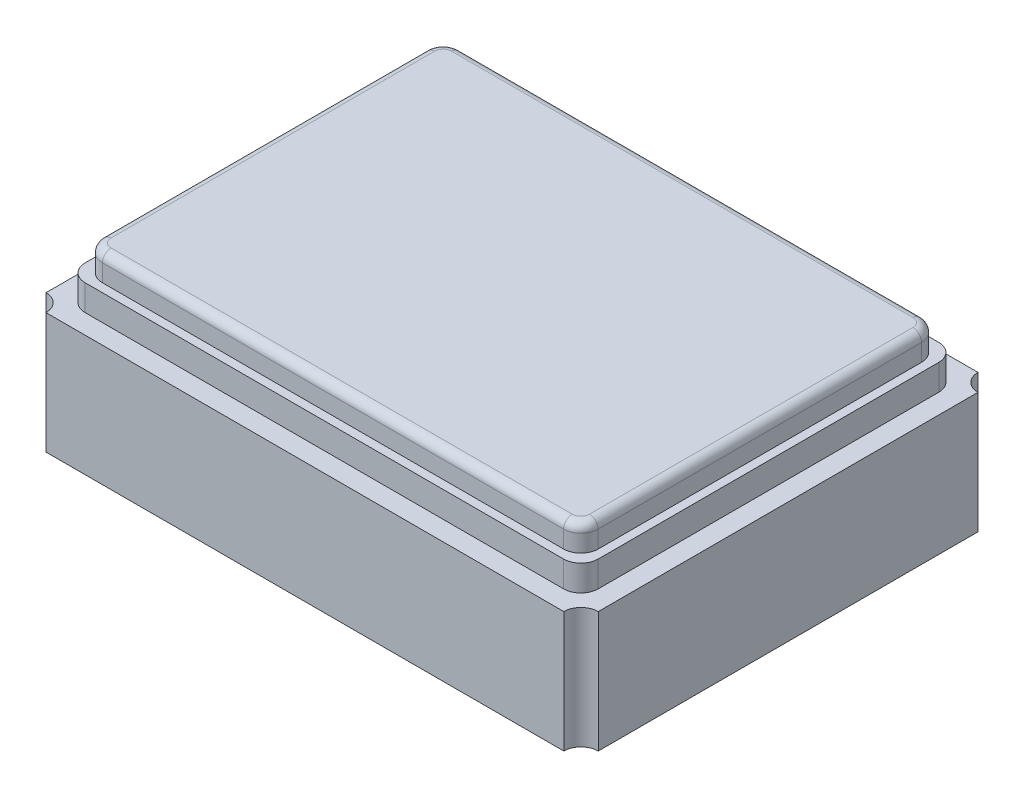
ISO-10303-21;
HEADER;
FILE_DESCRIPTION(('STEP AP214'),'2;1');
FILE_NAME('part.step','',(''),(''),'','','');
FILE_SCHEMA(('AUTOMOTIVE_DESIGN { 1 0 10303 214 1 1 1 1 }'));
ENDSEC;
DATA;
#1=APPLICATION_CONTEXT('core data for automotive mechanical design processes');
#2=APPLICATION_PROTOCOL_DEFINITION('international standard','automotive_design',2000,#1);
#3=PRODUCT_CONTEXT('',#1,'mechanical');
#4=PRODUCT('Part','Part','',(#3));
#5=PRODUCT_RELATED_PRODUCT_CATEGORY('part','',(#4));
#6=PRODUCT_DEFINITION_FORMATION('','',#4);
#7=PRODUCT_DEFINITION_CONTEXT('part definition',#1,'design');
#8=PRODUCT_DEFINITION('design','',#6,#7);
#9=PRODUCT_DEFINITION_SHAPE('','',#8);
#10=(LENGTH_UNIT() NAMED_UNIT(*) SI_UNIT(.MILLI.,.METRE.));
#11=(NAMED_UNIT(*) PLANE_ANGLE_UNIT() SI_UNIT($,.RADIAN.));
#12=(NAMED_UNIT(*) SI_UNIT($,.STERADIAN.) SOLID_ANGLE_UNIT());
#13=UNCERTAINTY_MEASURE_WITH_UNIT(LENGTH_MEASURE(1.E-05),#10,'distance_accuracy_value','');
#14=(GEOMETRIC_REPRESENTATION_CONTEXT(3) GLOBAL_UNCERTAINTY_ASSIGNED_CONTEXT((#13)) GLOBAL_UNIT_ASSIGNED_CONTEXT((#10,
#11,#12)) REPRESENTATION_CONTEXT('',''));
#15=CARTESIAN_POINT('',(0.,0.,0.));
#16=DIRECTION('',(0.,0.,1.));
#17=DIRECTION('',(1.,0.,0.));
#18=AXIS2_PLACEMENT_3D('',#15,#16,#17);
#19=CARTESIAN_POINT('',(-1.33609678096629,1.,0.936846899512658));
#20=DIRECTION('',(0.,-1.,0.));
#21=DIRECTION('',(0.,0.,-1.));
#22=AXIS2_PLACEMENT_3D('',#19,#20,#21);
#23=CYLINDRICAL_SURFACE('',#22,0.0999999999999999);
#24=DIRECTION('',(0.,-1.,0.));
#25=VECTOR('',#24,1.);
#26=CARTESIAN_POINT('',(-1.33609678096629,1.,1.03684689951266));
#27=LINE('',#26,#25);
#28=CARTESIAN_POINT('',(-1.33609678096629,0.95,1.03684689951266));
#29=VERTEX_POINT('',#28);
#30=CARTESIAN_POINT('',(-1.33609678096629,0.85,1.03684689951266));
#31=VERTEX_POINT('',#30);
#32=EDGE_CURVE('E132',#29,#31,#27,.T.);
#33=ORIENTED_EDGE('',*,*,#32,.F.);
#34=CARTESIAN_POINT('',(-1.33609678096629,0.95,0.936846899512658));
#35=DIRECTION('',(0.,-1.,0.));
#36=DIRECTION('',(0.,0.,-1.));
#37=AXIS2_PLACEMENT_3D('',#34,#35,#36);
#38=CIRCLE('',#37,0.0999999999999999);
#39=CARTESIAN_POINT('',(-1.43609678096628,0.95,0.936846899512658));
#40=VERTEX_POINT('',#39);
#41=EDGE_CURVE('E12',#29,#40,#38,.T.);
#42=ORIENTED_EDGE('',*,*,#41,.T.);
#43=DIRECTION('',(0.,-1.,0.));
#44=VECTOR('',#43,1.);
#45=CARTESIAN_POINT('',(-1.43609678096628,1.,0.936846899512658));
#46=LINE('',#45,#44);
#47=CARTESIAN_POINT('',(-1.43609678096628,0.85,0.936846899512658));
#48=VERTEX_POINT('',#47);
#49=EDGE_CURVE('E153',#40,#48,#46,.T.);
#50=ORIENTED_EDGE('',*,*,#49,.T.);
#51=CARTESIAN_POINT('',(-1.33609678096629,0.85,0.936846899512658));
#52=DIRECTION('',(0.,1.,0.));
#53=DIRECTION('',(0.,0.,-1.));
#54=AXIS2_PLACEMENT_3D('',#51,#52,#53);
#55=CIRCLE('',#54,0.0999999999999999);
#56=EDGE_CURVE('E147',#48,#31,#55,.T.);
#57=ORIENTED_EDGE('',*,*,#56,.T.);
#58=EDGE_LOOP('',(#33,#42,#50,#57));
#59=FACE_BOUND('',#58,.T.);
#60=ADVANCED_FACE('F44',(#59),#23,.T.);
#61=CARTESIAN_POINT('',(-1.33609678096629,1.,1.03684689951266));
#62=DIRECTION('',(0.,0.,-1.));
#63=DIRECTION('',(-1.,0.,0.));
#64=AXIS2_PLACEMENT_3D('',#61,#62,#63);
#65=PLANE('',#64);
#66=DIRECTION('',(0.,-1.,0.));
#67=VECTOR('',#66,1.);
#68=CARTESIAN_POINT('',(1.33609678096629,1.,1.03684689951266));
#69=LINE('',#68,#67);
#70=CARTESIAN_POINT('',(1.33609678096629,0.95,1.03684689951266));
#71=VERTEX_POINT('',#70);
#72=CARTESIAN_POINT('',(1.33609678096629,0.85,1.03684689951266));
#73=VERTEX_POINT('',#72);
#74=EDGE_CURVE('E141',#71,#73,#69,.T.);
#75=ORIENTED_EDGE('',*,*,#74,.F.);
#76=DIRECTION('',(1.,0.,0.));
#77=VECTOR('',#76,1.);
#78=CARTESIAN_POINT('',(-1.33609678096629,0.95,1.03684689951266));
#79=LINE('',#78,#77);
#80=EDGE_CURVE('E53',#71,#29,#79,.F.);
#81=ORIENTED_EDGE('',*,*,#80,.T.);
#82=ORIENTED_EDGE('',*,*,#32,.T.);
#83=DIRECTION('',(1.,0.,0.));
#84=VECTOR('',#83,1.);
#85=CARTESIAN_POINT('',(-1.33609678096629,0.85,1.03684689951266));
#86=LINE('',#85,#84);
#87=EDGE_CURVE('E135',#31,#73,#86,.T.);
#88=ORIENTED_EDGE('',*,*,#87,.T.);
#89=EDGE_LOOP('',(#75,#81,#82,#88));
#90=FACE_BOUND('',#89,.T.);
#91=ADVANCED_FACE('F134',(#90),#65,.F.);
#92=CARTESIAN_POINT('',(1.33609678096629,1.,0.936846899512658));
#93=DIRECTION('',(0.,-1.,0.));
#94=DIRECTION('',(0.,0.,-1.));
#95=AXIS2_PLACEMENT_3D('',#92,#93,#94);
#96=CYLINDRICAL_SURFACE('',#95,0.1);
#97=DIRECTION('',(0.,-1.,0.));
#98=VECTOR('',#97,1.);
#99=CARTESIAN_POINT('',(1.43609678096629,1.,0.936846899512658));
#100=LINE('',#99,#98);
#101=CARTESIAN_POINT('',(1.43609678096629,0.95,0.936846899512658));
#102=VERTEX_POINT('',#101);
#103=CARTESIAN_POINT('',(1.43609678096629,0.85,0.936846899512658));
#104=VERTEX_POINT('',#103);
#105=EDGE_CURVE('E183',#102,#104,#100,.T.);
#106=ORIENTED_EDGE('',*,*,#105,.F.);
#107=CARTESIAN_POINT('',(1.33609678096629,0.95,0.936846899512658));
#108=DIRECTION('',(0.,-1.,0.));
#109=DIRECTION('',(0.,0.,-1.));
#110=AXIS2_PLACEMENT_3D('',#107,#108,#109);
#111=CIRCLE('',#110,0.1);
#112=EDGE_CURVE('E68',#102,#71,#111,.T.);
#113=ORIENTED_EDGE('',*,*,#112,.T.);
#114=ORIENTED_EDGE('',*,*,#74,.T.);
#115=CARTESIAN_POINT('',(1.33609678096629,0.85,0.936846899512658));
#116=DIRECTION('',(0.,1.,0.));
#117=DIRECTION('',(0.,0.,1.));
#118=AXIS2_PLACEMENT_3D('',#115,#116,#117);
#119=CIRCLE('',#118,0.1);
#120=EDGE_CURVE('E150',#73,#104,#119,.T.);
#121=ORIENTED_EDGE('',*,*,#120,.T.);
#122=EDGE_LOOP('',(#106,#113,#114,#121));
#123=FACE_BOUND('',#122,.T.);
#124=ADVANCED_FACE('F286',(#123),#96,.T.);
#125=CARTESIAN_POINT('',(1.43609678096629,1.,0.936846899512658));
#126=DIRECTION('',(-1.,0.,0.));
#127=DIRECTION('',(0.,0.,1.));
#128=AXIS2_PLACEMENT_3D('',#125,#126,#127);
#129=PLANE('',#128);
#130=DIRECTION('',(0.,-1.,0.));
#131=VECTOR('',#130,1.);
#132=CARTESIAN_POINT('',(1.43609678096629,1.,-0.936846899512658));
#133=LINE('',#132,#131);
#134=CARTESIAN_POINT('',(1.43609678096629,0.95,-0.936846899512658));
#135=VERTEX_POINT('',#134);
#136=CARTESIAN_POINT('',(1.43609678096629,0.85,-0.936846899512658));
#137=VERTEX_POINT('',#136);
#138=EDGE_CURVE('E181',#135,#137,#133,.T.);
#139=ORIENTED_EDGE('',*,*,#138,.F.);
#140=DIRECTION('',(0.,0.,-1.));
#141=VECTOR('',#140,1.);
#142=CARTESIAN_POINT('',(1.43609678096629,0.95,0.936846899512658));
#143=LINE('',#142,#141);
#144=EDGE_CURVE('E211',#135,#102,#143,.F.);
#145=ORIENTED_EDGE('',*,*,#144,.T.);
#146=ORIENTED_EDGE('',*,*,#105,.T.);
#147=DIRECTION('',(0.,0.,-1.));
#148=VECTOR('',#147,1.);
#149=CARTESIAN_POINT('',(1.43609678096629,0.85,0.936846899512658));
#150=LINE('',#149,#148);
#151=EDGE_CURVE('E160',#104,#137,#150,.T.);
#152=ORIENTED_EDGE('',*,*,#151,.T.);
#153=EDGE_LOOP('',(#139,#145,#146,#152));
#154=FACE_BOUND('',#153,.T.);
#155=ADVANCED_FACE('F284',(#154),#129,.F.);
#156=CARTESIAN_POINT('',(1.33609678096629,1.,-0.936846899512658));
#157=DIRECTION('',(0.,-1.,0.));
#158=DIRECTION('',(0.,0.,-1.));
#159=AXIS2_PLACEMENT_3D('',#156,#157,#158);
#160=CYLINDRICAL_SURFACE('',#159,0.1);
#161=DIRECTION('',(0.,-1.,0.));
#162=VECTOR('',#161,1.);
#163=CARTESIAN_POINT('',(1.33609678096629,1.,-1.03684689951266));
#164=LINE('',#163,#162);
#165=CARTESIAN_POINT('',(1.33609678096629,0.95,-1.03684689951266));
#166=VERTEX_POINT('',#165);
#167=CARTESIAN_POINT('',(1.33609678096629,0.85,-1.03684689951266));
#168=VERTEX_POINT('',#167);
#169=EDGE_CURVE('E179',#166,#168,#164,.T.);
#170=ORIENTED_EDGE('',*,*,#169,.F.);
#171=CARTESIAN_POINT('',(1.33609678096629,0.95,-0.936846899512658));
#172=DIRECTION('',(0.,-1.,0.));
#173=DIRECTION('',(0.,0.,-1.));
#174=AXIS2_PLACEMENT_3D('',#171,#172,#173);
#175=CIRCLE('',#174,0.1);
#176=EDGE_CURVE('E209',#166,#135,#175,.T.);
#177=ORIENTED_EDGE('',*,*,#176,.T.);
#178=ORIENTED_EDGE('',*,*,#138,.T.);
#179=CARTESIAN_POINT('',(1.33609678096629,0.85,-0.936846899512658));
#180=DIRECTION('',(0.,1.,0.));
#181=DIRECTION('',(0.,0.,1.));
#182=AXIS2_PLACEMENT_3D('',#179,#180,#181);
#183=CIRCLE('',#182,0.1);
#184=EDGE_CURVE('E163',#137,#168,#183,.T.);
#185=ORIENTED_EDGE('',*,*,#184,.T.);
#186=EDGE_LOOP('',(#170,#177,#178,#185));
#187=FACE_BOUND('',#186,.T.);
#188=ADVANCED_FACE('F282',(#187),#160,.T.);
#189=CARTESIAN_POINT('',(1.33609678096629,1.,-1.03684689951266));
#190=DIRECTION('',(0.,0.,1.));
#191=DIRECTION('',(1.,0.,0.));
#192=AXIS2_PLACEMENT_3D('',#189,#190,#191);
#193=PLANE('',#192);
#194=DIRECTION('',(0.,-1.,0.));
#195=VECTOR('',#194,1.);
#196=CARTESIAN_POINT('',(-1.33609678096629,1.,-1.03684689951266));
#197=LINE('',#196,#195);
#198=CARTESIAN_POINT('',(-1.33609678096629,0.95,-1.03684689951266));
#199=VERTEX_POINT('',#198);
#200=CARTESIAN_POINT('',(-1.33609678096629,0.85,-1.03684689951266));
#201=VERTEX_POINT('',#200);
#202=EDGE_CURVE('E177',#199,#201,#197,.T.);
#203=ORIENTED_EDGE('',*,*,#202,.F.);
#204=DIRECTION('',(-1.,0.,0.));
#205=VECTOR('',#204,1.);
#206=CARTESIAN_POINT('',(1.33609678096629,0.95,-1.03684689951266));
#207=LINE('',#206,#205);
#208=EDGE_CURVE('E207',#199,#166,#207,.F.);
#209=ORIENTED_EDGE('',*,*,#208,.T.);
#210=ORIENTED_EDGE('',*,*,#169,.T.);
#211=DIRECTION('',(-1.,0.,0.));
#212=VECTOR('',#211,1.);
#213=CARTESIAN_POINT('',(1.33609678096629,0.85,-1.03684689951266));
#214=LINE('',#213,#212);
#215=EDGE_CURVE('E166',#168,#201,#214,.T.);
#216=ORIENTED_EDGE('',*,*,#215,.T.);
#217=EDGE_LOOP('',(#203,#209,#210,#216));
#218=FACE_BOUND('',#217,.T.);
#219=ADVANCED_FACE('F270',(#218),#193,.F.);
#220=CARTESIAN_POINT('',(-1.33609678096629,1.,-0.936846899512658));
#221=DIRECTION('',(0.,-1.,0.));
#222=DIRECTION('',(0.,0.,-1.));
#223=AXIS2_PLACEMENT_3D('',#220,#221,#222);
#224=CYLINDRICAL_SURFACE('',#223,0.1);
#225=DIRECTION('',(0.,-1.,0.));
#226=VECTOR('',#225,1.);
#227=CARTESIAN_POINT('',(-1.43609678096629,1.,-0.936846899512658));
#228=LINE('',#227,#226);
#229=CARTESIAN_POINT('',(-1.43609678096629,0.95,-0.936846899512658));
#230=VERTEX_POINT('',#229);
#231=CARTESIAN_POINT('',(-1.43609678096629,0.85,-0.936846899512658));
#232=VERTEX_POINT('',#231);
#233=EDGE_CURVE('E175',#230,#232,#228,.T.);
#234=ORIENTED_EDGE('',*,*,#233,.F.);
#235=CARTESIAN_POINT('',(-1.33609678096629,0.95,-0.936846899512658));
#236=DIRECTION('',(0.,-1.,0.));
#237=DIRECTION('',(0.,0.,-1.));
#238=AXIS2_PLACEMENT_3D('',#235,#236,#237);
#239=CIRCLE('',#238,0.1);
#240=EDGE_CURVE('E205',#230,#199,#239,.T.);
#241=ORIENTED_EDGE('',*,*,#240,.T.);
#242=ORIENTED_EDGE('',*,*,#202,.T.);
#243=CARTESIAN_POINT('',(-1.33609678096629,0.85,-0.936846899512658));
#244=DIRECTION('',(0.,1.,0.));
#245=DIRECTION('',(0.,0.,1.));
#246=AXIS2_PLACEMENT_3D('',#243,#244,#245);
#247=CIRCLE('',#246,0.1);
#248=EDGE_CURVE('E169',#201,#232,#247,.T.);
#249=ORIENTED_EDGE('',*,*,#248,.T.);
#250=EDGE_LOOP('',(#234,#241,#242,#249));
#251=FACE_BOUND('',#250,.T.);
#252=ADVANCED_FACE('F267',(#251),#224,.T.);
#253=CARTESIAN_POINT('',(-1.43609678096629,1.,-0.936846899512658));
#254=DIRECTION('',(1.,0.,0.));
#255=DIRECTION('',(0.,0.,-1.));
#256=AXIS2_PLACEMENT_3D('',#253,#254,#255);
#257=PLANE('',#256);
#258=ORIENTED_EDGE('',*,*,#49,.F.);
#259=DIRECTION('',(0.,0.,1.));
#260=VECTOR('',#259,1.);
#261=CARTESIAN_POINT('',(-1.43609678096629,0.95,-0.936846899512658));
#262=LINE('',#261,#260);
#263=EDGE_CURVE('E202',#40,#230,#262,.F.);
#264=ORIENTED_EDGE('',*,*,#263,.T.);
#265=ORIENTED_EDGE('',*,*,#233,.T.);
#266=DIRECTION('',(0.,0.,1.));
#267=VECTOR('',#266,1.);
#268=CARTESIAN_POINT('',(-1.43609678096629,0.85,-0.936846899512658));
#269=LINE('',#268,#267);
#270=EDGE_CURVE('E172',#232,#48,#269,.T.);
#271=ORIENTED_EDGE('',*,*,#270,.T.);
#272=EDGE_LOOP('',(#258,#264,#265,#271));
#273=FACE_BOUND('',#272,.T.);
#274=ADVANCED_FACE('F254',(#273),#257,.F.);
#275=CARTESIAN_POINT('',(-1.33609678096629,1.,0.936846899512658));
#276=DIRECTION('',(0.,-1.,0.));
#277=DIRECTION('',(0.,0.,-1.));
#278=AXIS2_PLACEMENT_3D('',#275,#276,#277);
#279=PLANE('',#278);
#280=CARTESIAN_POINT('',(-1.33609678096629,1.,-0.936846899512658));
#281=DIRECTION('',(0.,-1.,0.));
#282=DIRECTION('',(0.,0.,-1.));
#283=AXIS2_PLACEMENT_3D('',#280,#281,#282);
#284=CIRCLE('',#283,0.05);
#285=CARTESIAN_POINT('',(-1.33609678096629,1.,-0.986846899512658));
#286=VERTEX_POINT('',#285);
#287=CARTESIAN_POINT('',(-1.38609678096629,1.,-0.936846899512658));
#288=VERTEX_POINT('',#287);
#289=EDGE_CURVE('E197',#286,#288,#284,.F.);
#290=ORIENTED_EDGE('',*,*,#289,.T.);
#291=DIRECTION('',(0.,0.,1.));
#292=VECTOR('',#291,1.);
#293=CARTESIAN_POINT('',(-1.38609678096628,1.,0.936846899512658));
#294=LINE('',#293,#292);
#295=CARTESIAN_POINT('',(-1.38609678096628,1.,0.936846899512658));
#296=VERTEX_POINT('',#295);
#297=EDGE_CURVE('E199',#288,#296,#294,.T.);
#298=ORIENTED_EDGE('',*,*,#297,.T.);
#299=CARTESIAN_POINT('',(-1.33609678096629,1.,0.936846899512658));
#300=DIRECTION('',(0.,-1.,0.));
#301=DIRECTION('',(0.,0.,-1.));
#302=AXIS2_PLACEMENT_3D('',#299,#300,#301);
#303=CIRCLE('',#302,0.0499999999999999);
#304=CARTESIAN_POINT('',(-1.33609678096629,1.,0.986846899512658));
#305=VERTEX_POINT('',#304);
#306=EDGE_CURVE('E140',#296,#305,#303,.F.);
#307=ORIENTED_EDGE('',*,*,#306,.T.);
#308=DIRECTION('',(1.,0.,0.));
#309=VECTOR('',#308,1.);
#310=CARTESIAN_POINT('',(-1.33609678096629,1.,0.986846899512659));
#311=LINE('',#310,#309);
#312=CARTESIAN_POINT('',(1.33609678096629,1.,0.986846899512659));
#313=VERTEX_POINT('',#312);
#314=EDGE_CURVE('E187',#305,#313,#311,.T.);
#315=ORIENTED_EDGE('',*,*,#314,.T.);
#316=CARTESIAN_POINT('',(1.33609678096629,1.,0.936846899512658));
#317=DIRECTION('',(0.,-1.,0.));
#318=DIRECTION('',(0.,0.,-1.));
#319=AXIS2_PLACEMENT_3D('',#316,#317,#318);
#320=CIRCLE('',#319,0.05);
#321=CARTESIAN_POINT('',(1.38609678096629,1.,0.936846899512658));
#322=VERTEX_POINT('',#321);
#323=EDGE_CURVE('E189',#313,#322,#320,.F.);
#324=ORIENTED_EDGE('',*,*,#323,.T.);
#325=DIRECTION('',(0.,0.,-1.));
#326=VECTOR('',#325,1.);
#327=CARTESIAN_POINT('',(1.38609678096629,1.,0.936846899512658));
#328=LINE('',#327,#326);
#329=CARTESIAN_POINT('',(1.38609678096629,1.,-0.936846899512658));
#330=VERTEX_POINT('',#329);
#331=EDGE_CURVE('E191',#322,#330,#328,.T.);
#332=ORIENTED_EDGE('',*,*,#331,.T.);
#333=CARTESIAN_POINT('',(1.33609678096629,1.,-0.936846899512658));
#334=DIRECTION('',(0.,-1.,0.));
#335=DIRECTION('',(0.,0.,-1.));
#336=AXIS2_PLACEMENT_3D('',#333,#334,#335);
#337=CIRCLE('',#336,0.05);
#338=CARTESIAN_POINT('',(1.33609678096629,1.,-0.986846899512659));
#339=VERTEX_POINT('',#338);
#340=EDGE_CURVE('E193',#330,#339,#337,.F.);
#341=ORIENTED_EDGE('',*,*,#340,.T.);
#342=DIRECTION('',(-1.,0.,0.));
#343=VECTOR('',#342,1.);
#344=CARTESIAN_POINT('',(-1.33609678096629,1.,-0.986846899512658));
#345=LINE('',#344,#343);
#346=EDGE_CURVE('E195',#339,#286,#345,.T.);
#347=ORIENTED_EDGE('',*,*,#346,.T.);
#348=EDGE_LOOP('',(#290,#298,#307,#315,#324,#332,#341,#347));
#349=FACE_BOUND('',#348,.T.);
#350=ADVANCED_FACE('F242',(#349),#279,.F.);
#351=CARTESIAN_POINT('',(-1.33609678096629,0.85,0.936846899512658));
#352=DIRECTION('',(0.,-1.,0.));
#353=DIRECTION('',(0.,0.,-1.));
#354=AXIS2_PLACEMENT_3D('',#351,#352,#353);
#355=PLANE('',#354);
#356=ORIENTED_EDGE('',*,*,#56,.F.);
#357=ORIENTED_EDGE('',*,*,#270,.F.);
#358=ORIENTED_EDGE('',*,*,#248,.F.);
#359=ORIENTED_EDGE('',*,*,#215,.F.);
#360=ORIENTED_EDGE('',*,*,#184,.F.);
#361=ORIENTED_EDGE('',*,*,#151,.F.);
#362=ORIENTED_EDGE('',*,*,#120,.F.);
#363=ORIENTED_EDGE('',*,*,#87,.F.);
#364=EDGE_LOOP('',(#356,#357,#358,#359,#360,#361,#362,#363));
#365=FACE_BOUND('',#364,.T.);
#366=ADVANCED_FACE('F145',(#365),#355,.T.);
#367=CARTESIAN_POINT('',(1.38609678096629,0.95,0.936846899512658));
#368=DIRECTION('',(0.,0.,-1.));
#369=DIRECTION('',(-1.,0.,0.));
#370=AXIS2_PLACEMENT_3D('',#367,#368,#369);
#371=CYLINDRICAL_SURFACE('',#370,0.05);
#372=CARTESIAN_POINT('',(1.38609678096629,0.95,0.936846899512658));
#373=DIRECTION('',(0.,0.,1.));
#374=DIRECTION('',(1.,0.,0.));
#375=AXIS2_PLACEMENT_3D('',#372,#373,#374);
#376=CIRCLE('',#375,0.05);
#377=EDGE_CURVE('E157',#102,#322,#376,.T.);
#378=ORIENTED_EDGE('',*,*,#377,.F.);
#379=ORIENTED_EDGE('',*,*,#144,.F.);
#380=CARTESIAN_POINT('',(1.38609678096629,0.95,-0.936846899512658));
#381=DIRECTION('',(0.,0.,-1.));
#382=DIRECTION('',(-1.,0.,0.));
#383=AXIS2_PLACEMENT_3D('',#380,#381,#382);
#384=CIRCLE('',#383,0.05);
#385=EDGE_CURVE('E48',#330,#135,#384,.T.);
#386=ORIENTED_EDGE('',*,*,#385,.F.);
#387=ORIENTED_EDGE('',*,*,#331,.F.);
#388=EDGE_LOOP('',(#378,#379,#386,#387));
#389=FACE_BOUND('',#388,.T.);
#390=ADVANCED_FACE('F46',(#389),#371,.T.);
#391=CARTESIAN_POINT('',(1.33609678096629,0.95,-0.936846899512658));
#392=DIRECTION('',(0.,-1.,0.));
#393=DIRECTION('',(0.,0.,-1.));
#394=AXIS2_PLACEMENT_3D('',#391,#392,#393);
#395=TOROIDAL_SURFACE('',#394,0.05,0.05);
#396=ORIENTED_EDGE('',*,*,#385,.T.);
#397=ORIENTED_EDGE('',*,*,#176,.F.);
#398=CARTESIAN_POINT('',(1.33609678096629,0.95,-0.986846899512659));
#399=DIRECTION('',(-1.,0.,0.));
#400=DIRECTION('',(0.,0.,1.));
#401=AXIS2_PLACEMENT_3D('',#398,#399,#400);
#402=CIRCLE('',#401,0.05);
#403=EDGE_CURVE('E228',#339,#166,#402,.T.);
#404=ORIENTED_EDGE('',*,*,#403,.F.);
#405=ORIENTED_EDGE('',*,*,#340,.F.);
#406=EDGE_LOOP('',(#396,#397,#404,#405));
#407=FACE_BOUND('',#406,.T.);
#408=ADVANCED_FACE('F279',(#407),#395,.T.);
#409=CARTESIAN_POINT('',(1.33609678096629,0.95,0.936846899512658));
#410=DIRECTION('',(0.,-1.,0.));
#411=DIRECTION('',(0.,0.,-1.));
#412=AXIS2_PLACEMENT_3D('',#409,#410,#411);
#413=DEGENERATE_TOROIDAL_SURFACE('',#412,0.05,0.05,.T.);
#414=ORIENTED_EDGE('',*,*,#377,.T.);
#415=ORIENTED_EDGE('',*,*,#323,.F.);
#416=CARTESIAN_POINT('',(1.33609678096629,0.95,0.986846899512658));
#417=DIRECTION('',(-1.,0.,0.));
#418=DIRECTION('',(0.,0.,1.));
#419=AXIS2_PLACEMENT_3D('',#416,#417,#418);
#420=CIRCLE('',#419,0.05);
#421=EDGE_CURVE('E225',#71,#313,#420,.T.);
#422=ORIENTED_EDGE('',*,*,#421,.F.);
#423=ORIENTED_EDGE('',*,*,#112,.F.);
#424=EDGE_LOOP('',(#414,#415,#422,#423));
#425=FACE_BOUND('',#424,.T.);
#426=ADVANCED_FACE('F234',(#425),#413,.T.);
#427=CARTESIAN_POINT('',(-1.33609678096629,0.95,-0.986846899512658));
#428=DIRECTION('',(-1.,0.,0.));
#429=DIRECTION('',(0.,0.,1.));
#430=AXIS2_PLACEMENT_3D('',#427,#428,#429);
#431=CYLINDRICAL_SURFACE('',#430,0.05);
#432=ORIENTED_EDGE('',*,*,#403,.T.);
#433=ORIENTED_EDGE('',*,*,#208,.F.);
#434=CARTESIAN_POINT('',(-1.33609678096629,0.95,-0.986846899512658));
#435=DIRECTION('',(-1.,0.,0.));
#436=DIRECTION('',(0.,0.,1.));
#437=AXIS2_PLACEMENT_3D('',#434,#435,#436);
#438=CIRCLE('',#437,0.05);
#439=EDGE_CURVE('E222',#286,#199,#438,.T.);
#440=ORIENTED_EDGE('',*,*,#439,.F.);
#441=ORIENTED_EDGE('',*,*,#346,.F.);
#442=EDGE_LOOP('',(#432,#433,#440,#441));
#443=FACE_BOUND('',#442,.T.);
#444=ADVANCED_FACE('F275',(#443),#431,.T.);
#445=CARTESIAN_POINT('',(-1.33609678096629,0.95,0.986846899512659));
#446=DIRECTION('',(1.,0.,0.));
#447=DIRECTION('',(0.,0.,-1.));
#448=AXIS2_PLACEMENT_3D('',#445,#446,#447);
#449=CYLINDRICAL_SURFACE('',#448,0.05);
#450=ORIENTED_EDGE('',*,*,#421,.T.);
#451=ORIENTED_EDGE('',*,*,#314,.F.);
#452=CARTESIAN_POINT('',(-1.33609678096629,0.95,0.986846899512659));
#453=DIRECTION('',(-1.,0.,0.));
#454=DIRECTION('',(0.,0.,1.));
#455=AXIS2_PLACEMENT_3D('',#452,#453,#454);
#456=CIRCLE('',#455,0.05);
#457=EDGE_CURVE('E219',#29,#305,#456,.T.);
#458=ORIENTED_EDGE('',*,*,#457,.F.);
#459=ORIENTED_EDGE('',*,*,#80,.F.);
#460=EDGE_LOOP('',(#450,#451,#458,#459));
#461=FACE_BOUND('',#460,.T.);
#462=ADVANCED_FACE('F247',(#461),#449,.T.);
#463=CARTESIAN_POINT('',(-1.33609678096629,0.95,-0.936846899512658));
#464=DIRECTION('',(0.,-1.,0.));
#465=DIRECTION('',(0.,0.,-1.));
#466=AXIS2_PLACEMENT_3D('',#463,#464,#465);
#467=TOROIDAL_SURFACE('',#466,0.05,0.05);
#468=ORIENTED_EDGE('',*,*,#439,.T.);
#469=ORIENTED_EDGE('',*,*,#240,.F.);
#470=CARTESIAN_POINT('',(-1.38609678096629,0.95,-0.936846899512658));
#471=DIRECTION('',(0.,0.,1.));
#472=DIRECTION('',(1.,0.,0.));
#473=AXIS2_PLACEMENT_3D('',#470,#471,#472);
#474=CIRCLE('',#473,0.05);
#475=EDGE_CURVE('E217',#288,#230,#474,.T.);
#476=ORIENTED_EDGE('',*,*,#475,.F.);
#477=ORIENTED_EDGE('',*,*,#289,.F.);
#478=EDGE_LOOP('',(#468,#469,#476,#477));
#479=FACE_BOUND('',#478,.T.);
#480=ADVANCED_FACE('F263',(#479),#467,.T.);
#481=CARTESIAN_POINT('',(-1.33609678096629,0.95,0.936846899512658));
#482=DIRECTION('',(0.,-1.,0.));
#483=DIRECTION('',(0.,0.,-1.));
#484=AXIS2_PLACEMENT_3D('',#481,#482,#483);
#485=DEGENERATE_TOROIDAL_SURFACE('',#484,0.0499999999999999,0.05,.T.);
#486=ORIENTED_EDGE('',*,*,#457,.T.);
#487=ORIENTED_EDGE('',*,*,#306,.F.);
#488=CARTESIAN_POINT('',(-1.38609678096628,0.95,0.936846899512658));
#489=DIRECTION('',(0.,0.,-1.));
#490=DIRECTION('',(-1.,0.,0.));
#491=AXIS2_PLACEMENT_3D('',#488,#489,#490);
#492=CIRCLE('',#491,0.05);
#493=EDGE_CURVE('E215',#40,#296,#492,.T.);
#494=ORIENTED_EDGE('',*,*,#493,.F.);
#495=ORIENTED_EDGE('',*,*,#41,.F.);
#496=EDGE_LOOP('',(#486,#487,#494,#495));
#497=FACE_BOUND('',#496,.T.);
#498=ADVANCED_FACE('F250',(#497),#485,.T.);
#499=CARTESIAN_POINT('',(-1.38609678096628,0.95,0.936846899512658));
#500=DIRECTION('',(0.,0.,1.));
#501=DIRECTION('',(1.,0.,0.));
#502=AXIS2_PLACEMENT_3D('',#499,#500,#501);
#503=CYLINDRICAL_SURFACE('',#502,0.05);
#504=ORIENTED_EDGE('',*,*,#475,.T.);
#505=ORIENTED_EDGE('',*,*,#263,.F.);
#506=ORIENTED_EDGE('',*,*,#493,.T.);
#507=ORIENTED_EDGE('',*,*,#297,.F.);
#508=EDGE_LOOP('',(#504,#505,#506,#507));
#509=FACE_BOUND('',#508,.T.);
#510=ADVANCED_FACE('F257',(#509),#503,.T.);
#511=CLOSED_SHELL('',(#60,#91,#124,#155,#188,#219,#252,#274,#350,#366,#390,#408,#426,#444,#462,
#480,#498,#510));
#512=MANIFOLD_SOLID_BREP('B2',#511);
#513=CARTESIAN_POINT('',(-1.38609678096629,0.85,0.986846899512658));
#514=DIRECTION('',(0.,-1.,0.));
#515=DIRECTION('',(0.,0.,-1.));
#516=AXIS2_PLACEMENT_3D('',#513,#514,#515);
#517=CYLINDRICAL_SURFACE('',#516,0.1);
#518=CARTESIAN_POINT('',(-1.38609678096629,0.7,0.986846899512658));
#519=DIRECTION('',(0.,1.,0.));
#520=DIRECTION('',(0.,0.,-1.));
#521=AXIS2_PLACEMENT_3D('',#518,#519,#520);
#522=CIRCLE('',#521,0.1);
#523=CARTESIAN_POINT('',(-1.48609678096629,0.7,0.986846899512658));
#524=VERTEX_POINT('',#523);
#525=CARTESIAN_POINT('',(-1.38609678096628,0.7,1.08684689951266));
#526=VERTEX_POINT('',#525);
#527=EDGE_CURVE('E537',#524,#526,#522,.T.);
#528=ORIENTED_EDGE('',*,*,#527,.T.);
#529=DIRECTION('',(0.,-1.,0.));
#530=VECTOR('',#529,1.);
#531=CARTESIAN_POINT('',(-1.38609678096628,0.85,1.08684689951266));
#532=LINE('',#531,#530);
#533=CARTESIAN_POINT('',(-1.38609678096628,0.85,1.08684689951266));
#534=VERTEX_POINT('',#533);
#535=EDGE_CURVE('E42',#534,#526,#532,.T.);
#536=ORIENTED_EDGE('',*,*,#535,.F.);
#537=CARTESIAN_POINT('',(-1.38609678096629,0.85,0.986846899512658));
#538=DIRECTION('',(0.,1.,0.));
#539=DIRECTION('',(0.,0.,-1.));
#540=AXIS2_PLACEMENT_3D('',#537,#538,#539);
#541=CIRCLE('',#540,0.1);
#542=CARTESIAN_POINT('',(-1.48609678096629,0.85,0.986846899512658));
#543=VERTEX_POINT('',#542);
#544=EDGE_CURVE('E551',#543,#534,#541,.T.);
#545=ORIENTED_EDGE('',*,*,#544,.F.);
#546=DIRECTION('',(0.,-1.,0.));
#547=VECTOR('',#546,1.);
#548=CARTESIAN_POINT('',(-1.48609678096629,0.85,0.986846899512658));
#549=LINE('',#548,#547);
#550=EDGE_CURVE('E533',#543,#524,#549,.T.);
#551=ORIENTED_EDGE('',*,*,#550,.T.);
#552=EDGE_LOOP('',(#528,#536,#545,#551));
#553=FACE_BOUND('',#552,.T.);
#554=ADVANCED_FACE('F441',(#553),#517,.T.);
#555=CARTESIAN_POINT('',(-1.38609678096628,0.85,1.08684689951266));
#556=DIRECTION('',(0.,0.,-1.));
#557=DIRECTION('',(-1.,0.,0.));
#558=AXIS2_PLACEMENT_3D('',#555,#556,#557);
#559=PLANE('',#558);
#560=DIRECTION('',(1.,0.,0.));
#561=VECTOR('',#560,1.);
#562=CARTESIAN_POINT('',(-1.38609678096628,0.7,1.08684689951266));
#563=LINE('',#562,#561);
#564=CARTESIAN_POINT('',(1.38609678096628,0.7,1.08684689951266));
#565=VERTEX_POINT('',#564);
#566=EDGE_CURVE('E540',#526,#565,#563,.T.);
#567=ORIENTED_EDGE('',*,*,#566,.T.);
#568=DIRECTION('',(0.,-1.,0.));
#569=VECTOR('',#568,1.);
#570=CARTESIAN_POINT('',(1.38609678096628,0.85,1.08684689951266));
#571=LINE('',#570,#569);
#572=CARTESIAN_POINT('',(1.38609678096628,0.85,1.08684689951266));
#573=VERTEX_POINT('',#572);
#574=EDGE_CURVE('E449',#573,#565,#571,.T.);
#575=ORIENTED_EDGE('',*,*,#574,.F.);
#576=DIRECTION('',(1.,0.,0.));
#577=VECTOR('',#576,1.);
#578=CARTESIAN_POINT('',(-1.38609678096628,0.85,1.08684689951266));
#579=LINE('',#578,#577);
#580=EDGE_CURVE('E500',#534,#573,#579,.T.);
#581=ORIENTED_EDGE('',*,*,#580,.F.);
#582=ORIENTED_EDGE('',*,*,#535,.T.);
#583=EDGE_LOOP('',(#567,#575,#581,#582));
#584=FACE_BOUND('',#583,.T.);
#585=ADVANCED_FACE('F586',(#584),#559,.F.);
#586=CARTESIAN_POINT('',(1.38609678096629,0.85,0.986846899512658));
#587=DIRECTION('',(0.,-1.,0.));
#588=DIRECTION('',(0.,0.,-1.));
#589=AXIS2_PLACEMENT_3D('',#586,#587,#588);
#590=CYLINDRICAL_SURFACE('',#589,0.1);
#591=CARTESIAN_POINT('',(1.38609678096629,0.7,0.986846899512658));
#592=DIRECTION('',(0.,1.,0.));
#593=DIRECTION('',(0.,0.,1.));
#594=AXIS2_PLACEMENT_3D('',#591,#592,#593);
#595=CIRCLE('',#594,0.1);
#596=CARTESIAN_POINT('',(1.48609678096629,0.7,0.986846899512658));
#597=VERTEX_POINT('',#596);
#598=EDGE_CURVE('E542',#565,#597,#595,.T.);
#599=ORIENTED_EDGE('',*,*,#598,.T.);
#600=DIRECTION('',(0.,-1.,0.));
#601=VECTOR('',#600,1.);
#602=CARTESIAN_POINT('',(1.48609678096629,0.85,0.986846899512658));
#603=LINE('',#602,#601);
#604=CARTESIAN_POINT('',(1.48609678096629,0.85,0.986846899512658));
#605=VERTEX_POINT('',#604);
#606=EDGE_CURVE('E558',#605,#597,#603,.T.);
#607=ORIENTED_EDGE('',*,*,#606,.F.);
#608=CARTESIAN_POINT('',(1.38609678096629,0.85,0.986846899512658));
#609=DIRECTION('',(0.,1.,0.));
#610=DIRECTION('',(0.,0.,1.));
#611=AXIS2_PLACEMENT_3D('',#608,#609,#610);
#612=CIRCLE('',#611,0.1);
#613=EDGE_CURVE('E566',#573,#605,#612,.T.);
#614=ORIENTED_EDGE('',*,*,#613,.F.);
#615=ORIENTED_EDGE('',*,*,#574,.T.);
#616=EDGE_LOOP('',(#599,#607,#614,#615));
#617=FACE_BOUND('',#616,.T.);
#618=ADVANCED_FACE('F564',(#617),#590,.T.);
#619=CARTESIAN_POINT('',(1.48609678096629,0.85,0.986846899512658));
#620=DIRECTION('',(-1.,0.,0.));
#621=DIRECTION('',(0.,0.,1.));
#622=AXIS2_PLACEMENT_3D('',#619,#620,#621);
#623=PLANE('',#622);
#624=DIRECTION('',(0.,0.,-1.));
#625=VECTOR('',#624,1.);
#626=CARTESIAN_POINT('',(1.48609678096629,0.7,0.986846899512658));
#627=LINE('',#626,#625);
#628=CARTESIAN_POINT('',(1.48609678096629,0.7,-0.986846899512658));
#629=VERTEX_POINT('',#628);
#630=EDGE_CURVE('E544',#597,#629,#627,.T.);
#631=ORIENTED_EDGE('',*,*,#630,.T.);
#632=DIRECTION('',(0.,-1.,0.));
#633=VECTOR('',#632,1.);
#634=CARTESIAN_POINT('',(1.48609678096629,0.85,-0.986846899512658));
#635=LINE('',#634,#633);
#636=CARTESIAN_POINT('',(1.48609678096629,0.85,-0.986846899512658));
#637=VERTEX_POINT('',#636);
#638=EDGE_CURVE('E555',#637,#629,#635,.T.);
#639=ORIENTED_EDGE('',*,*,#638,.F.);
#640=DIRECTION('',(0.,0.,-1.));
#641=VECTOR('',#640,1.);
#642=CARTESIAN_POINT('',(1.48609678096629,0.85,0.986846899512658));
#643=LINE('',#642,#641);
#644=EDGE_CURVE('E578',#605,#637,#643,.T.);
#645=ORIENTED_EDGE('',*,*,#644,.F.);
#646=ORIENTED_EDGE('',*,*,#606,.T.);
#647=EDGE_LOOP('',(#631,#639,#645,#646));
#648=FACE_BOUND('',#647,.T.);
#649=ADVANCED_FACE('F574',(#648),#623,.F.);
#650=CARTESIAN_POINT('',(1.38609678096629,0.85,-0.986846899512658));
#651=DIRECTION('',(0.,-1.,0.));
#652=DIRECTION('',(0.,0.,-1.));
#653=AXIS2_PLACEMENT_3D('',#650,#651,#652);
#654=CYLINDRICAL_SURFACE('',#653,0.1);
#655=CARTESIAN_POINT('',(1.38609678096629,0.7,-0.986846899512658));
#656=DIRECTION('',(0.,1.,0.));
#657=DIRECTION('',(0.,0.,-1.));
#658=AXIS2_PLACEMENT_3D('',#655,#656,#657);
#659=CIRCLE('',#658,0.1);
#660=CARTESIAN_POINT('',(1.38609678096628,0.7,-1.08684689951266));
#661=VERTEX_POINT('',#660);
#662=EDGE_CURVE('E546',#629,#661,#659,.T.);
#663=ORIENTED_EDGE('',*,*,#662,.T.);
#664=DIRECTION('',(0.,-1.,0.));
#665=VECTOR('',#664,1.);
#666=CARTESIAN_POINT('',(1.38609678096628,0.85,-1.08684689951266));
#667=LINE('',#666,#665);
#668=CARTESIAN_POINT('',(1.38609678096628,0.85,-1.08684689951266));
#669=VERTEX_POINT('',#668);
#670=EDGE_CURVE('E528',#669,#661,#667,.T.);
#671=ORIENTED_EDGE('',*,*,#670,.F.);
#672=CARTESIAN_POINT('',(1.38609678096629,0.85,-0.986846899512658));
#673=DIRECTION('',(0.,1.,0.));
#674=DIRECTION('',(0.,0.,-1.));
#675=AXIS2_PLACEMENT_3D('',#672,#673,#674);
#676=CIRCLE('',#675,0.1);
#677=EDGE_CURVE('E519',#637,#669,#676,.T.);
#678=ORIENTED_EDGE('',*,*,#677,.F.);
#679=ORIENTED_EDGE('',*,*,#638,.T.);
#680=EDGE_LOOP('',(#663,#671,#678,#679));
#681=FACE_BOUND('',#680,.T.);
#682=ADVANCED_FACE('F577',(#681),#654,.T.);
#683=CARTESIAN_POINT('',(-1.38609678096628,0.85,-1.08684689951266));
#684=DIRECTION('',(0.,0.,1.));
#685=DIRECTION('',(1.,0.,0.));
#686=AXIS2_PLACEMENT_3D('',#683,#684,#685);
#687=PLANE('',#686);
#688=DIRECTION('',(-1.,0.,0.));
#689=VECTOR('',#688,1.);
#690=CARTESIAN_POINT('',(-1.38609678096628,0.7,-1.08684689951266));
#691=LINE('',#690,#689);
#692=CARTESIAN_POINT('',(-1.38609678096628,0.7,-1.08684689951266));
#693=VERTEX_POINT('',#692);
#694=EDGE_CURVE('E527',#661,#693,#691,.T.);
#695=ORIENTED_EDGE('',*,*,#694,.T.);
#696=DIRECTION('',(0.,-1.,0.));
#697=VECTOR('',#696,1.);
#698=CARTESIAN_POINT('',(-1.38609678096628,0.85,-1.08684689951266));
#699=LINE('',#698,#697);
#700=CARTESIAN_POINT('',(-1.38609678096628,0.85,-1.08684689951266));
#701=VERTEX_POINT('',#700);
#702=EDGE_CURVE('E524',#701,#693,#699,.T.);
#703=ORIENTED_EDGE('',*,*,#702,.F.);
#704=DIRECTION('',(-1.,0.,0.));
#705=VECTOR('',#704,1.);
#706=CARTESIAN_POINT('',(-1.38609678096628,0.85,-1.08684689951266));
#707=LINE('',#706,#705);
#708=EDGE_CURVE('E513',#669,#701,#707,.T.);
#709=ORIENTED_EDGE('',*,*,#708,.F.);
#710=ORIENTED_EDGE('',*,*,#670,.T.);
#711=EDGE_LOOP('',(#695,#703,#709,#710));
#712=FACE_BOUND('',#711,.T.);
#713=ADVANCED_FACE('F525',(#712),#687,.F.);
#714=CARTESIAN_POINT('',(-1.38609678096629,0.85,-0.986846899512658));
#715=DIRECTION('',(0.,-1.,0.));
#716=DIRECTION('',(0.,0.,-1.));
#717=AXIS2_PLACEMENT_3D('',#714,#715,#716);
#718=CYLINDRICAL_SURFACE('',#717,0.1);
#719=CARTESIAN_POINT('',(-1.38609678096629,0.7,-0.986846899512658));
#720=DIRECTION('',(0.,1.,0.));
#721=DIRECTION('',(0.,0.,-1.));
#722=AXIS2_PLACEMENT_3D('',#719,#720,#721);
#723=CIRCLE('',#722,0.1);
#724=CARTESIAN_POINT('',(-1.48609678096629,0.7,-0.986846899512658));
#725=VERTEX_POINT('',#724);
#726=EDGE_CURVE('E486',#693,#725,#723,.T.);
#727=ORIENTED_EDGE('',*,*,#726,.T.);
#728=DIRECTION('',(0.,-1.,0.));
#729=VECTOR('',#728,1.);
#730=CARTESIAN_POINT('',(-1.48609678096629,0.85,-0.986846899512658));
#731=LINE('',#730,#729);
#732=CARTESIAN_POINT('',(-1.48609678096629,0.85,-0.986846899512658));
#733=VERTEX_POINT('',#732);
#734=EDGE_CURVE('E529',#733,#725,#731,.T.);
#735=ORIENTED_EDGE('',*,*,#734,.F.);
#736=CARTESIAN_POINT('',(-1.38609678096629,0.85,-0.986846899512658));
#737=DIRECTION('',(0.,1.,0.));
#738=DIRECTION('',(0.,0.,-1.));
#739=AXIS2_PLACEMENT_3D('',#736,#737,#738);
#740=CIRCLE('',#739,0.1);
#741=EDGE_CURVE('E517',#701,#733,#740,.T.);
#742=ORIENTED_EDGE('',*,*,#741,.F.);
#743=ORIENTED_EDGE('',*,*,#702,.T.);
#744=EDGE_LOOP('',(#727,#735,#742,#743));
#745=FACE_BOUND('',#744,.T.);
#746=ADVANCED_FACE('F531',(#745),#718,.T.);
#747=CARTESIAN_POINT('',(-1.48609678096629,0.85,0.986846899512658));
#748=DIRECTION('',(1.,0.,0.));
#749=DIRECTION('',(0.,0.,-1.));
#750=AXIS2_PLACEMENT_3D('',#747,#748,#749);
#751=PLANE('',#750);
#752=DIRECTION('',(0.,0.,1.));
#753=VECTOR('',#752,1.);
#754=CARTESIAN_POINT('',(-1.48609678096629,0.7,0.986846899512658));
#755=LINE('',#754,#753);
#756=EDGE_CURVE('E492',#725,#524,#755,.T.);
#757=ORIENTED_EDGE('',*,*,#756,.T.);
#758=ORIENTED_EDGE('',*,*,#550,.F.);
#759=DIRECTION('',(0.,0.,1.));
#760=VECTOR('',#759,1.);
#761=CARTESIAN_POINT('',(-1.48609678096629,0.85,0.986846899512658));
#762=LINE('',#761,#760);
#763=EDGE_CURVE('E457',#733,#543,#762,.T.);
#764=ORIENTED_EDGE('',*,*,#763,.F.);
#765=ORIENTED_EDGE('',*,*,#734,.T.);
#766=EDGE_LOOP('',(#757,#758,#764,#765));
#767=FACE_BOUND('',#766,.T.);
#768=ADVANCED_FACE('F602',(#767),#751,.F.);
#769=CARTESIAN_POINT('',(-1.38609678096629,0.85,0.986846899512658));
#770=DIRECTION('',(0.,-1.,0.));
#771=DIRECTION('',(0.,0.,-1.));
#772=AXIS2_PLACEMENT_3D('',#769,#770,#771);
#773=PLANE('',#772);
#774=ORIENTED_EDGE('',*,*,#544,.T.);
#775=ORIENTED_EDGE('',*,*,#580,.T.);
#776=ORIENTED_EDGE('',*,*,#613,.T.);
#777=ORIENTED_EDGE('',*,*,#644,.T.);
#778=ORIENTED_EDGE('',*,*,#677,.T.);
#779=ORIENTED_EDGE('',*,*,#708,.T.);
#780=ORIENTED_EDGE('',*,*,#741,.T.);
#781=ORIENTED_EDGE('',*,*,#763,.T.);
#782=EDGE_LOOP('',(#774,#775,#776,#777,#778,#779,#780,#781));
#783=FACE_BOUND('',#782,.T.);
#784=ADVANCED_FACE('F515',(#783),#773,.F.);
#785=CARTESIAN_POINT('',(-1.38609678096629,0.7,0.986846899512658));
#786=DIRECTION('',(0.,-1.,0.));
#787=DIRECTION('',(0.,0.,-1.));
#788=AXIS2_PLACEMENT_3D('',#785,#786,#787);
#789=PLANE('',#788);
#790=ORIENTED_EDGE('',*,*,#527,.F.);
#791=ORIENTED_EDGE('',*,*,#756,.F.);
#792=ORIENTED_EDGE('',*,*,#726,.F.);
#793=ORIENTED_EDGE('',*,*,#694,.F.);
#794=ORIENTED_EDGE('',*,*,#662,.F.);
#795=ORIENTED_EDGE('',*,*,#630,.F.);
#796=ORIENTED_EDGE('',*,*,#598,.F.);
#797=ORIENTED_EDGE('',*,*,#566,.F.);
#798=EDGE_LOOP('',(#790,#791,#792,#793,#794,#795,#796,#797));
#799=FACE_BOUND('',#798,.T.);
#800=ADVANCED_FACE('F570',(#799),#789,.T.);
#801=CLOSED_SHELL('',(#554,#585,#618,#649,#682,#713,#746,#768,#784,#800));
#802=MANIFOLD_SOLID_BREP('B6',#801);
#803=CARTESIAN_POINT('',(1.6,0.7,1.2));
#804=DIRECTION('',(-1.,0.,0.));
#805=DIRECTION('',(0.,0.,1.));
#806=AXIS2_PLACEMENT_3D('',#803,#804,#805);
#807=PLANE('',#806);
#808=DIRECTION('',(0.,0.,-1.));
#809=VECTOR('',#808,1.);
#810=CARTESIAN_POINT('',(1.6,0.7,1.2));
#811=LINE('',#810,#809);
#812=CARTESIAN_POINT('',(1.6,0.7,1.1));
#813=VERTEX_POINT('',#812);
#814=CARTESIAN_POINT('',(1.6,0.7,-1.1));
#815=VERTEX_POINT('',#814);
#816=EDGE_CURVE('E747',#813,#815,#811,.T.);
#817=ORIENTED_EDGE('',*,*,#816,.F.);
#818=DIRECTION('',(0.,1.,0.));
#819=VECTOR('',#818,1.);
#820=CARTESIAN_POINT('',(1.6,0.,1.1));
#821=LINE('',#820,#819);
#822=CARTESIAN_POINT('',(1.6,0.,1.1));
#823=VERTEX_POINT('',#822);
#824=EDGE_CURVE('E783',#813,#823,#821,.F.);
#825=ORIENTED_EDGE('',*,*,#824,.T.);
#826=DIRECTION('',(0.,0.,-1.));
#827=VECTOR('',#826,1.);
#828=CARTESIAN_POINT('',(1.6,0.,1.2));
#829=LINE('',#828,#827);
#830=CARTESIAN_POINT('',(1.6,0.,-1.1));
#831=VERTEX_POINT('',#830);
#832=EDGE_CURVE('E755',#823,#831,#829,.T.);
#833=ORIENTED_EDGE('',*,*,#832,.T.);
#834=DIRECTION('',(0.,1.,0.));
#835=VECTOR('',#834,1.);
#836=CARTESIAN_POINT('',(1.6,0.,-1.1));
#837=LINE('',#836,#835);
#838=EDGE_CURVE('E772',#831,#815,#837,.T.);
#839=ORIENTED_EDGE('',*,*,#838,.T.);
#840=EDGE_LOOP('',(#817,#825,#833,#839));
#841=FACE_BOUND('',#840,.T.);
#842=ADVANCED_FACE('F669',(#841),#807,.F.);
#843=CARTESIAN_POINT('',(-1.6,0.7,-1.2));
#844=DIRECTION('',(0.,0.,1.));
#845=DIRECTION('',(1.,0.,0.));
#846=AXIS2_PLACEMENT_3D('',#843,#844,#845);
#847=PLANE('',#846);
#848=DIRECTION('',(-1.,0.,0.));
#849=VECTOR('',#848,1.);
#850=CARTESIAN_POINT('',(-1.6,0.7,-1.2));
#851=LINE('',#850,#849);
#852=CARTESIAN_POINT('',(1.5,0.7,-1.2));
#853=VERTEX_POINT('',#852);
#854=CARTESIAN_POINT('',(-1.5,0.7,-1.2));
#855=VERTEX_POINT('',#854);
#856=EDGE_CURVE('E749',#853,#855,#851,.T.);
#857=ORIENTED_EDGE('',*,*,#856,.F.);
#858=DIRECTION('',(0.,1.,0.));
#859=VECTOR('',#858,1.);
#860=CARTESIAN_POINT('',(1.5,0.,-1.2));
#861=LINE('',#860,#859);
#862=CARTESIAN_POINT('',(1.5,0.,-1.2));
#863=VERTEX_POINT('',#862);
#864=EDGE_CURVE('E777',#853,#863,#861,.F.);
#865=ORIENTED_EDGE('',*,*,#864,.T.);
#866=DIRECTION('',(-1.,0.,0.));
#867=VECTOR('',#866,1.);
#868=CARTESIAN_POINT('',(-1.6,0.,-1.2));
#869=LINE('',#868,#867);
#870=CARTESIAN_POINT('',(-1.5,0.,-1.2));
#871=VERTEX_POINT('',#870);
#872=EDGE_CURVE('E751',#863,#871,#869,.T.);
#873=ORIENTED_EDGE('',*,*,#872,.T.);
#874=DIRECTION('',(0.,1.,0.));
#875=VECTOR('',#874,1.);
#876=CARTESIAN_POINT('',(-1.5,0.,-1.2));
#877=LINE('',#876,#875);
#878=EDGE_CURVE('E757',#871,#855,#877,.T.);
#879=ORIENTED_EDGE('',*,*,#878,.T.);
#880=EDGE_LOOP('',(#857,#865,#873,#879));
#881=FACE_BOUND('',#880,.T.);
#882=ADVANCED_FACE('F805',(#881),#847,.F.);
#883=CARTESIAN_POINT('',(-1.6,0.7,1.2));
#884=DIRECTION('',(1.,0.,0.));
#885=DIRECTION('',(0.,0.,-1.));
#886=AXIS2_PLACEMENT_3D('',#883,#884,#885);
#887=PLANE('',#886);
#888=DIRECTION('',(0.,0.,1.));
#889=VECTOR('',#888,1.);
#890=CARTESIAN_POINT('',(-1.6,0.,1.2));
#891=LINE('',#890,#889);
#892=CARTESIAN_POINT('',(-1.6,0.,-1.1));
#893=VERTEX_POINT('',#892);
#894=CARTESIAN_POINT('',(-1.6,0.,1.1));
#895=VERTEX_POINT('',#894);
#896=EDGE_CURVE('E748',#893,#895,#891,.T.);
#897=ORIENTED_EDGE('',*,*,#896,.T.);
#898=DIRECTION('',(0.,1.,0.));
#899=VECTOR('',#898,1.);
#900=CARTESIAN_POINT('',(-1.6,0.,1.1));
#901=LINE('',#900,#899);
#902=CARTESIAN_POINT('',(-1.6,0.7,1.1));
#903=VERTEX_POINT('',#902);
#904=EDGE_CURVE('E683',#895,#903,#901,.T.);
#905=ORIENTED_EDGE('',*,*,#904,.T.);
#906=DIRECTION('',(0.,0.,1.));
#907=VECTOR('',#906,1.);
#908=CARTESIAN_POINT('',(-1.6,0.7,1.2));
#909=LINE('',#908,#907);
#910=CARTESIAN_POINT('',(-1.6,0.7,-1.1));
#911=VERTEX_POINT('',#910);
#912=EDGE_CURVE('E759',#911,#903,#909,.T.);
#913=ORIENTED_EDGE('',*,*,#912,.F.);
#914=DIRECTION('',(0.,1.,0.));
#915=VECTOR('',#914,1.);
#916=CARTESIAN_POINT('',(-1.6,0.,-1.1));
#917=LINE('',#916,#915);
#918=EDGE_CURVE('E765',#911,#893,#917,.F.);
#919=ORIENTED_EDGE('',*,*,#918,.T.);
#920=EDGE_LOOP('',(#897,#905,#913,#919));
#921=FACE_BOUND('',#920,.T.);
#922=ADVANCED_FACE('F796',(#921),#887,.F.);
#923=CARTESIAN_POINT('',(-1.6,0.7,1.2));
#924=DIRECTION('',(0.,0.,-1.));
#925=DIRECTION('',(-1.,0.,0.));
#926=AXIS2_PLACEMENT_3D('',#923,#924,#925);
#927=PLANE('',#926);
#928=DIRECTION('',(1.,0.,0.));
#929=VECTOR('',#928,1.);
#930=CARTESIAN_POINT('',(-1.6,0.7,1.2));
#931=LINE('',#930,#929);
#932=CARTESIAN_POINT('',(-1.5,0.7,1.2));
#933=VERTEX_POINT('',#932);
#934=CARTESIAN_POINT('',(1.5,0.7,1.2));
#935=VERTEX_POINT('',#934);
#936=EDGE_CURVE('E676',#933,#935,#931,.T.);
#937=ORIENTED_EDGE('',*,*,#936,.F.);
#938=DIRECTION('',(0.,1.,0.));
#939=VECTOR('',#938,1.);
#940=CARTESIAN_POINT('',(-1.5,0.,1.2));
#941=LINE('',#940,#939);
#942=CARTESIAN_POINT('',(-1.5,0.,1.2));
#943=VERTEX_POINT('',#942);
#944=EDGE_CURVE('E733',#933,#943,#941,.F.);
#945=ORIENTED_EDGE('',*,*,#944,.T.);
#946=DIRECTION('',(1.,0.,0.));
#947=VECTOR('',#946,1.);
#948=CARTESIAN_POINT('',(-1.6,0.,1.2));
#949=LINE('',#948,#947);
#950=CARTESIAN_POINT('',(1.5,0.,1.2));
#951=VERTEX_POINT('',#950);
#952=EDGE_CURVE('E691',#943,#951,#949,.T.);
#953=ORIENTED_EDGE('',*,*,#952,.T.);
#954=DIRECTION('',(0.,1.,0.));
#955=VECTOR('',#954,1.);
#956=CARTESIAN_POINT('',(1.5,0.,1.2));
#957=LINE('',#956,#955);
#958=EDGE_CURVE('E786',#951,#935,#957,.T.);
#959=ORIENTED_EDGE('',*,*,#958,.T.);
#960=EDGE_LOOP('',(#937,#945,#953,#959));
#961=FACE_BOUND('',#960,.T.);
#962=ADVANCED_FACE('F741',(#961),#927,.F.);
#963=CARTESIAN_POINT('',(0.,0.7,0.));
#964=DIRECTION('',(0.,-1.,0.));
#965=DIRECTION('',(0.,0.,-1.));
#966=AXIS2_PLACEMENT_3D('',#963,#964,#965);
#967=PLANE('',#966);
#968=ORIENTED_EDGE('',*,*,#912,.T.);
#969=CARTESIAN_POINT('',(-1.6,0.7,1.2));
#970=DIRECTION('',(0.,1.,0.));
#971=DIRECTION('',(0.,0.,1.));
#972=AXIS2_PLACEMENT_3D('',#969,#970,#971);
#973=CIRCLE('',#972,0.1);
#974=EDGE_CURVE('E738',#933,#903,#973,.T.);
#975=ORIENTED_EDGE('',*,*,#974,.F.);
#976=ORIENTED_EDGE('',*,*,#936,.T.);
#977=CARTESIAN_POINT('',(1.6,0.7,1.2));
#978=DIRECTION('',(0.,1.,0.));
#979=DIRECTION('',(0.,0.,1.));
#980=AXIS2_PLACEMENT_3D('',#977,#978,#979);
#981=CIRCLE('',#980,0.1);
#982=EDGE_CURVE('E788',#813,#935,#981,.T.);
#983=ORIENTED_EDGE('',*,*,#982,.F.);
#984=ORIENTED_EDGE('',*,*,#816,.T.);
#985=CARTESIAN_POINT('',(1.6,0.7,-1.2));
#986=DIRECTION('',(0.,1.,0.));
#987=DIRECTION('',(0.,0.,1.));
#988=AXIS2_PLACEMENT_3D('',#985,#986,#987);
#989=CIRCLE('',#988,0.1);
#990=EDGE_CURVE('E780',#853,#815,#989,.T.);
#991=ORIENTED_EDGE('',*,*,#990,.F.);
#992=ORIENTED_EDGE('',*,*,#856,.T.);
#993=CARTESIAN_POINT('',(-1.6,0.7,-1.2));
#994=DIRECTION('',(0.,1.,0.));
#995=DIRECTION('',(0.,0.,1.));
#996=AXIS2_PLACEMENT_3D('',#993,#994,#995);
#997=CIRCLE('',#996,0.1);
#998=EDGE_CURVE('E769',#911,#855,#997,.T.);
#999=ORIENTED_EDGE('',*,*,#998,.F.);
#1000=EDGE_LOOP('',(#968,#975,#976,#983,#984,#991,#992,#999));
#1001=FACE_BOUND('',#1000,.T.);
#1002=ADVANCED_FACE('F798',(#1001),#967,.F.);
#1003=CARTESIAN_POINT('',(0.,0.,0.));
#1004=DIRECTION('',(0.,-1.,0.));
#1005=DIRECTION('',(0.,0.,-1.));
#1006=AXIS2_PLACEMENT_3D('',#1003,#1004,#1005);
#1007=PLANE('',#1006);
#1008=CARTESIAN_POINT('',(-1.6,0.,1.2));
#1009=DIRECTION('',(0.,1.,0.));
#1010=DIRECTION('',(0.,0.,1.));
#1011=AXIS2_PLACEMENT_3D('',#1008,#1009,#1010);
#1012=CIRCLE('',#1011,0.1);
#1013=EDGE_CURVE('E731',#943,#895,#1012,.T.);
#1014=ORIENTED_EDGE('',*,*,#1013,.T.);
#1015=ORIENTED_EDGE('',*,*,#896,.F.);
#1016=CARTESIAN_POINT('',(-1.6,0.,-1.2));
#1017=DIRECTION('',(0.,1.,0.));
#1018=DIRECTION('',(0.,0.,1.));
#1019=AXIS2_PLACEMENT_3D('',#1016,#1017,#1018);
#1020=CIRCLE('',#1019,0.1);
#1021=EDGE_CURVE('E768',#893,#871,#1020,.T.);
#1022=ORIENTED_EDGE('',*,*,#1021,.T.);
#1023=ORIENTED_EDGE('',*,*,#872,.F.);
#1024=CARTESIAN_POINT('',(1.6,0.,-1.2));
#1025=DIRECTION('',(0.,-1.,0.));
#1026=DIRECTION('',(0.,0.,-1.));
#1027=AXIS2_PLACEMENT_3D('',#1024,#1025,#1026);
#1028=CIRCLE('',#1027,0.1);
#1029=EDGE_CURVE('E439',#831,#863,#1028,.T.);
#1030=ORIENTED_EDGE('',*,*,#1029,.F.);
#1031=ORIENTED_EDGE('',*,*,#832,.F.);
#1032=CARTESIAN_POINT('',(1.6,0.,1.2));
#1033=DIRECTION('',(0.,1.,0.));
#1034=DIRECTION('',(0.,0.,1.));
#1035=AXIS2_PLACEMENT_3D('',#1032,#1033,#1034);
#1036=CIRCLE('',#1035,0.1);
#1037=EDGE_CURVE('E746',#823,#951,#1036,.T.);
#1038=ORIENTED_EDGE('',*,*,#1037,.T.);
#1039=ORIENTED_EDGE('',*,*,#952,.F.);
#1040=EDGE_LOOP('',(#1014,#1015,#1022,#1023,#1030,#1031,#1038,#1039));
#1041=FACE_BOUND('',#1040,.T.);
#1042=ADVANCED_FACE('F744',(#1041),#1007,.T.);
#1043=CARTESIAN_POINT('',(-1.6,0.,-1.2));
#1044=DIRECTION('',(0.,1.,0.));
#1045=DIRECTION('',(0.,0.,1.));
#1046=AXIS2_PLACEMENT_3D('',#1043,#1044,#1045);
#1047=CYLINDRICAL_SURFACE('',#1046,0.1);
#1048=ORIENTED_EDGE('',*,*,#1021,.F.);
#1049=ORIENTED_EDGE('',*,*,#918,.F.);
#1050=ORIENTED_EDGE('',*,*,#998,.T.);
#1051=ORIENTED_EDGE('',*,*,#878,.F.);
#1052=EDGE_LOOP('',(#1048,#1049,#1050,#1051));
#1053=FACE_BOUND('',#1052,.T.);
#1054=ADVANCED_FACE('F803',(#1053),#1047,.F.);
#1055=CARTESIAN_POINT('',(1.6,0.,-1.2));
#1056=DIRECTION('',(0.,1.,0.));
#1057=DIRECTION('',(0.,0.,1.));
#1058=AXIS2_PLACEMENT_3D('',#1055,#1056,#1057);
#1059=CYLINDRICAL_SURFACE('',#1058,0.1);
#1060=ORIENTED_EDGE('',*,*,#1029,.T.);
#1061=ORIENTED_EDGE('',*,*,#864,.F.);
#1062=ORIENTED_EDGE('',*,*,#990,.T.);
#1063=ORIENTED_EDGE('',*,*,#838,.F.);
#1064=EDGE_LOOP('',(#1060,#1061,#1062,#1063));
#1065=FACE_BOUND('',#1064,.T.);
#1066=ADVANCED_FACE('F810',(#1065),#1059,.F.);
#1067=CARTESIAN_POINT('',(1.6,0.,1.2));
#1068=DIRECTION('',(0.,1.,0.));
#1069=DIRECTION('',(0.,0.,1.));
#1070=AXIS2_PLACEMENT_3D('',#1067,#1068,#1069);
#1071=CYLINDRICAL_SURFACE('',#1070,0.1);
#1072=ORIENTED_EDGE('',*,*,#982,.T.);
#1073=ORIENTED_EDGE('',*,*,#958,.F.);
#1074=ORIENTED_EDGE('',*,*,#1037,.F.);
#1075=ORIENTED_EDGE('',*,*,#824,.F.);
#1076=EDGE_LOOP('',(#1072,#1073,#1074,#1075));
#1077=FACE_BOUND('',#1076,.T.);
#1078=ADVANCED_FACE('F815',(#1077),#1071,.F.);
#1079=CARTESIAN_POINT('',(-1.6,0.,1.2));
#1080=DIRECTION('',(0.,1.,0.));
#1081=DIRECTION('',(0.,0.,1.));
#1082=AXIS2_PLACEMENT_3D('',#1079,#1080,#1081);
#1083=CYLINDRICAL_SURFACE('',#1082,0.1);
#1084=ORIENTED_EDGE('',*,*,#1013,.F.);
#1085=ORIENTED_EDGE('',*,*,#944,.F.);
#1086=ORIENTED_EDGE('',*,*,#974,.T.);
#1087=ORIENTED_EDGE('',*,*,#904,.F.);
#1088=EDGE_LOOP('',(#1084,#1085,#1086,#1087));
#1089=FACE_BOUND('',#1088,.T.);
#1090=ADVANCED_FACE('F732',(#1089),#1083,.F.);
#1091=CLOSED_SHELL('',(#842,#882,#922,#962,#1002,#1042,#1054,#1066,#1078,#1090));
#1092=MANIFOLD_SOLID_BREP('B36',#1091);
#1093=ADVANCED_BREP_SHAPE_REPRESENTATION('',(#18,#512,#802,#1092),#14);
#1094=SHAPE_DEFINITION_REPRESENTATION(#9,#1093);
ENDSEC;
END-ISO-10303-21;
